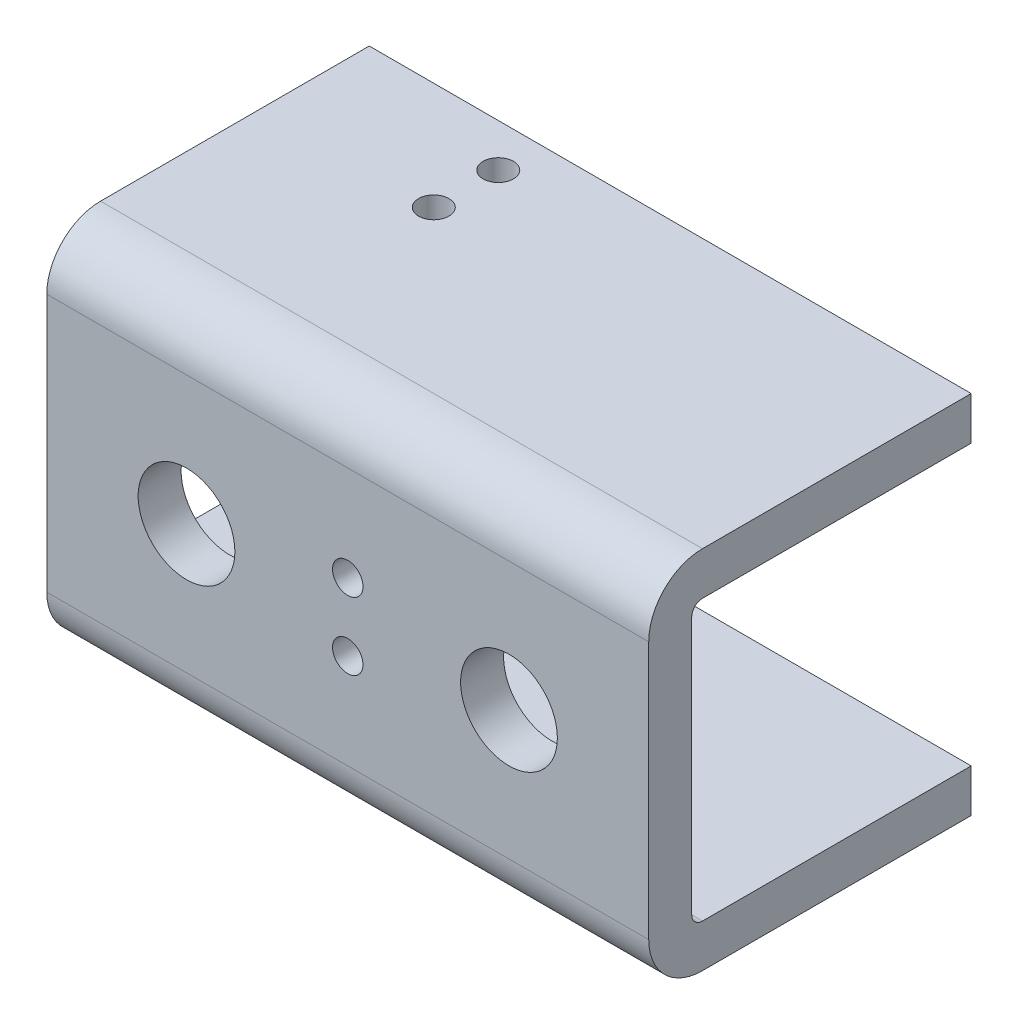
ISO-10303-21;
HEADER;
FILE_DESCRIPTION(('STEP AP214'),'2;1');
FILE_NAME('part.step','',(''),(''),'','','');
FILE_SCHEMA(('AUTOMOTIVE_DESIGN { 1 0 10303 214 1 1 1 1 }'));
ENDSEC;
DATA;
#1=APPLICATION_CONTEXT('core data for automotive mechanical design processes');
#2=APPLICATION_PROTOCOL_DEFINITION('international standard','automotive_design',2000,#1);
#3=PRODUCT_CONTEXT('',#1,'mechanical');
#4=PRODUCT('Part','Part','',(#3));
#5=PRODUCT_RELATED_PRODUCT_CATEGORY('part','',(#4));
#6=PRODUCT_DEFINITION_FORMATION('','',#4);
#7=PRODUCT_DEFINITION_CONTEXT('part definition',#1,'design');
#8=PRODUCT_DEFINITION('design','',#6,#7);
#9=PRODUCT_DEFINITION_SHAPE('','',#8);
#10=(LENGTH_UNIT() NAMED_UNIT(*) SI_UNIT(.MILLI.,.METRE.));
#11=(NAMED_UNIT(*) PLANE_ANGLE_UNIT() SI_UNIT($,.RADIAN.));
#12=(NAMED_UNIT(*) SI_UNIT($,.STERADIAN.) SOLID_ANGLE_UNIT());
#13=UNCERTAINTY_MEASURE_WITH_UNIT(LENGTH_MEASURE(1.E-05),#10,'distance_accuracy_value','');
#14=(GEOMETRIC_REPRESENTATION_CONTEXT(3) GLOBAL_UNCERTAINTY_ASSIGNED_CONTEXT((#13)) GLOBAL_UNIT_ASSIGNED_CONTEXT((#10,
#11,#12)) REPRESENTATION_CONTEXT('',''));
#15=CARTESIAN_POINT('',(0.,0.,0.));
#16=DIRECTION('',(0.,0.,1.));
#17=DIRECTION('',(1.,0.,0.));
#18=AXIS2_PLACEMENT_3D('',#15,#16,#17);
#19=CARTESIAN_POINT('',(44.45,26.9875,20.6375));
#20=DIRECTION('',(-1.,0.,0.));
#21=DIRECTION('',(0.,0.,1.));
#22=AXIS2_PLACEMENT_3D('',#19,#20,#21);
#23=PLANE('',#22);
#24=DIRECTION('',(0.,0.,-1.));
#25=VECTOR('',#24,1.);
#26=CARTESIAN_POINT('',(44.45,-20.6375,20.6375));
#27=LINE('',#26,#25);
#28=CARTESIAN_POINT('',(44.45,-20.6375,12.7));
#29=VERTEX_POINT('',#28);
#30=CARTESIAN_POINT('',(44.45,-20.6375,-26.9875));
#31=VERTEX_POINT('',#30);
#32=EDGE_CURVE('E132',#29,#31,#27,.T.);
#33=ORIENTED_EDGE('',*,*,#32,.F.);
#34=CARTESIAN_POINT('',(44.45,-19.05,12.7));
#35=DIRECTION('',(-1.,0.,0.));
#36=DIRECTION('',(0.,0.,1.));
#37=AXIS2_PLACEMENT_3D('',#34,#35,#36);
#38=CIRCLE('',#37,1.5875);
#39=CARTESIAN_POINT('',(44.45,-19.05,14.2875));
#40=VERTEX_POINT('',#39);
#41=EDGE_CURVE('E251',#40,#29,#38,.F.);
#42=ORIENTED_EDGE('',*,*,#41,.F.);
#43=DIRECTION('',(0.,1.,0.));
#44=VECTOR('',#43,1.);
#45=CARTESIAN_POINT('',(44.45,26.9875,14.2875));
#46=LINE('',#45,#44);
#47=CARTESIAN_POINT('',(44.45,19.05,14.2875));
#48=VERTEX_POINT('',#47);
#49=EDGE_CURVE('E272',#40,#48,#46,.T.);
#50=ORIENTED_EDGE('',*,*,#49,.T.);
#51=CARTESIAN_POINT('',(44.45,19.05,12.7));
#52=DIRECTION('',(-1.,0.,0.));
#53=DIRECTION('',(0.,0.,1.));
#54=AXIS2_PLACEMENT_3D('',#51,#52,#53);
#55=CIRCLE('',#54,1.5875);
#56=CARTESIAN_POINT('',(44.45,20.6375,12.7));
#57=VERTEX_POINT('',#56);
#58=EDGE_CURVE('E255',#57,#48,#55,.F.);
#59=ORIENTED_EDGE('',*,*,#58,.F.);
#60=DIRECTION('',(0.,0.,-1.));
#61=VECTOR('',#60,1.);
#62=CARTESIAN_POINT('',(44.45,20.6375,20.6375));
#63=LINE('',#62,#61);
#64=CARTESIAN_POINT('',(44.45,20.6375,-26.9875));
#65=VERTEX_POINT('',#64);
#66=EDGE_CURVE('E144',#57,#65,#63,.T.);
#67=ORIENTED_EDGE('',*,*,#66,.T.);
#68=DIRECTION('',(0.,-1.,0.));
#69=VECTOR('',#68,1.);
#70=CARTESIAN_POINT('',(44.45,26.9875,-26.9875));
#71=LINE('',#70,#69);
#72=CARTESIAN_POINT('',(44.45,26.9875,-26.9875));
#73=VERTEX_POINT('',#72);
#74=EDGE_CURVE('E162',#73,#65,#71,.T.);
#75=ORIENTED_EDGE('',*,*,#74,.F.);
#76=DIRECTION('',(0.,0.,-1.));
#77=VECTOR('',#76,1.);
#78=CARTESIAN_POINT('',(44.45,26.9875,20.6375));
#79=LINE('',#78,#77);
#80=CARTESIAN_POINT('',(44.45,26.9875,12.7));
#81=VERTEX_POINT('',#80);
#82=EDGE_CURVE('E183',#81,#73,#79,.T.);
#83=ORIENTED_EDGE('',*,*,#82,.F.);
#84=CARTESIAN_POINT('',(44.45,19.05,12.7));
#85=DIRECTION('',(-1.,0.,0.));
#86=DIRECTION('',(0.,0.,1.));
#87=AXIS2_PLACEMENT_3D('',#84,#85,#86);
#88=CIRCLE('',#87,7.9375);
#89=CARTESIAN_POINT('',(44.45,19.05,20.6375));
#90=VERTEX_POINT('',#89);
#91=EDGE_CURVE('E199',#81,#90,#88,.F.);
#92=ORIENTED_EDGE('',*,*,#91,.T.);
#93=DIRECTION('',(0.,1.,0.));
#94=VECTOR('',#93,1.);
#95=CARTESIAN_POINT('',(44.45,26.9875,20.6375));
#96=LINE('',#95,#94);
#97=CARTESIAN_POINT('',(44.45,-19.05,20.6375));
#98=VERTEX_POINT('',#97);
#99=EDGE_CURVE('E176',#98,#90,#96,.T.);
#100=ORIENTED_EDGE('',*,*,#99,.F.);
#101=CARTESIAN_POINT('',(44.45,-19.05,12.7));
#102=DIRECTION('',(-1.,0.,0.));
#103=DIRECTION('',(0.,0.,1.));
#104=AXIS2_PLACEMENT_3D('',#101,#102,#103);
#105=CIRCLE('',#104,7.9375);
#106=CARTESIAN_POINT('',(44.45,-26.9875,12.7));
#107=VERTEX_POINT('',#106);
#108=EDGE_CURVE('E202',#98,#107,#105,.F.);
#109=ORIENTED_EDGE('',*,*,#108,.T.);
#110=DIRECTION('',(0.,0.,-1.));
#111=VECTOR('',#110,1.);
#112=CARTESIAN_POINT('',(44.45,-26.9875,20.6375));
#113=LINE('',#112,#111);
#114=CARTESIAN_POINT('',(44.45,-26.9875,-26.9875));
#115=VERTEX_POINT('',#114);
#116=EDGE_CURVE('E159',#107,#115,#113,.T.);
#117=ORIENTED_EDGE('',*,*,#116,.T.);
#118=EDGE_CURVE('E150',#31,#115,#71,.T.);
#119=ORIENTED_EDGE('',*,*,#118,.F.);
#120=EDGE_LOOP('',(#33,#42,#50,#59,#67,#75,#83,#92,#100,#109,#117,#119));
#121=FACE_BOUND('',#120,.T.);
#122=ADVANCED_FACE('F39',(#121),#23,.F.);
#123=CARTESIAN_POINT('',(0.,0.,-26.9875));
#124=DIRECTION('',(0.,0.,-1.));
#125=DIRECTION('',(-1.,0.,0.));
#126=AXIS2_PLACEMENT_3D('',#123,#124,#125);
#127=PLANE('',#126);
#128=DIRECTION('',(-1.,0.,0.));
#129=VECTOR('',#128,1.);
#130=CARTESIAN_POINT('',(-44.45,-20.6375,-26.9875));
#131=LINE('',#130,#129);
#132=CARTESIAN_POINT('',(-44.45,-20.6375,-26.9875));
#133=VERTEX_POINT('',#132);
#134=EDGE_CURVE('E136',#31,#133,#131,.T.);
#135=ORIENTED_EDGE('',*,*,#134,.F.);
#136=ORIENTED_EDGE('',*,*,#118,.T.);
#137=DIRECTION('',(-1.,0.,0.));
#138=VECTOR('',#137,1.);
#139=CARTESIAN_POINT('',(44.45,-26.9875,-26.9875));
#140=LINE('',#139,#138);
#141=CARTESIAN_POINT('',(-44.45,-26.9875,-26.9875));
#142=VERTEX_POINT('',#141);
#143=EDGE_CURVE('E261',#115,#142,#140,.T.);
#144=ORIENTED_EDGE('',*,*,#143,.T.);
#145=DIRECTION('',(0.,1.,0.));
#146=VECTOR('',#145,1.);
#147=CARTESIAN_POINT('',(-44.45,-26.9875,-26.9875));
#148=LINE('',#147,#146);
#149=EDGE_CURVE('E153',#142,#133,#148,.T.);
#150=ORIENTED_EDGE('',*,*,#149,.T.);
#151=EDGE_LOOP('',(#135,#136,#144,#150));
#152=FACE_BOUND('',#151,.T.);
#153=ADVANCED_FACE('F148',(#152),#127,.T.);
#154=CARTESIAN_POINT('',(-44.45,26.9875,20.6375));
#155=DIRECTION('',(1.,0.,0.));
#156=DIRECTION('',(0.,0.,-1.));
#157=AXIS2_PLACEMENT_3D('',#154,#155,#156);
#158=PLANE('',#157);
#159=CARTESIAN_POINT('',(-44.45,-19.05,12.7));
#160=DIRECTION('',(1.,0.,0.));
#161=DIRECTION('',(0.,0.,-1.));
#162=AXIS2_PLACEMENT_3D('',#159,#160,#161);
#163=CIRCLE('',#162,1.5875);
#164=CARTESIAN_POINT('',(-44.45,-20.6375,12.7));
#165=VERTEX_POINT('',#164);
#166=CARTESIAN_POINT('',(-44.45,-19.05,14.2875));
#167=VERTEX_POINT('',#166);
#168=EDGE_CURVE('E262',#165,#167,#163,.F.);
#169=ORIENTED_EDGE('',*,*,#168,.F.);
#170=DIRECTION('',(0.,0.,-1.));
#171=VECTOR('',#170,1.);
#172=CARTESIAN_POINT('',(-44.45,-20.6375,20.6375));
#173=LINE('',#172,#171);
#174=EDGE_CURVE('E143',#165,#133,#173,.T.);
#175=ORIENTED_EDGE('',*,*,#174,.T.);
#176=ORIENTED_EDGE('',*,*,#149,.F.);
#177=DIRECTION('',(0.,0.,-1.));
#178=VECTOR('',#177,1.);
#179=CARTESIAN_POINT('',(-44.45,-26.9875,20.6375));
#180=LINE('',#179,#178);
#181=CARTESIAN_POINT('',(-44.45,-26.9875,12.7));
#182=VERTEX_POINT('',#181);
#183=EDGE_CURVE('E188',#182,#142,#180,.T.);
#184=ORIENTED_EDGE('',*,*,#183,.F.);
#185=CARTESIAN_POINT('',(-44.45,-19.05,12.7));
#186=DIRECTION('',(1.,0.,0.));
#187=DIRECTION('',(0.,0.,-1.));
#188=AXIS2_PLACEMENT_3D('',#185,#186,#187);
#189=CIRCLE('',#188,7.9375);
#190=CARTESIAN_POINT('',(-44.45,-19.05,20.6375));
#191=VERTEX_POINT('',#190);
#192=EDGE_CURVE('E49',#182,#191,#189,.F.);
#193=ORIENTED_EDGE('',*,*,#192,.T.);
#194=DIRECTION('',(0.,-1.,0.));
#195=VECTOR('',#194,1.);
#196=CARTESIAN_POINT('',(-44.45,26.9875,20.6375));
#197=LINE('',#196,#195);
#198=CARTESIAN_POINT('',(-44.45,19.05,20.6375));
#199=VERTEX_POINT('',#198);
#200=EDGE_CURVE('E168',#199,#191,#197,.T.);
#201=ORIENTED_EDGE('',*,*,#200,.F.);
#202=CARTESIAN_POINT('',(-44.45,19.05,12.7));
#203=DIRECTION('',(1.,0.,0.));
#204=DIRECTION('',(0.,0.,-1.));
#205=AXIS2_PLACEMENT_3D('',#202,#203,#204);
#206=CIRCLE('',#205,7.9375);
#207=CARTESIAN_POINT('',(-44.45,26.9875,12.7));
#208=VERTEX_POINT('',#207);
#209=EDGE_CURVE('E65',#199,#208,#206,.F.);
#210=ORIENTED_EDGE('',*,*,#209,.T.);
#211=DIRECTION('',(0.,0.,-1.));
#212=VECTOR('',#211,1.);
#213=CARTESIAN_POINT('',(-44.45,26.9875,20.6375));
#214=LINE('',#213,#212);
#215=CARTESIAN_POINT('',(-44.45,26.9875,-26.9875));
#216=VERTEX_POINT('',#215);
#217=EDGE_CURVE('E180',#208,#216,#214,.T.);
#218=ORIENTED_EDGE('',*,*,#217,.T.);
#219=CARTESIAN_POINT('',(-44.45,20.6375,-26.9875));
#220=VERTEX_POINT('',#219);
#221=EDGE_CURVE('E290',#220,#216,#148,.T.);
#222=ORIENTED_EDGE('',*,*,#221,.F.);
#223=DIRECTION('',(0.,0.,-1.));
#224=VECTOR('',#223,1.);
#225=CARTESIAN_POINT('',(-44.45,20.6375,20.6375));
#226=LINE('',#225,#224);
#227=CARTESIAN_POINT('',(-44.45,20.6375,12.7));
#228=VERTEX_POINT('',#227);
#229=EDGE_CURVE('E57',#228,#220,#226,.T.);
#230=ORIENTED_EDGE('',*,*,#229,.F.);
#231=CARTESIAN_POINT('',(-44.45,19.05,12.7));
#232=DIRECTION('',(1.,0.,0.));
#233=DIRECTION('',(0.,0.,-1.));
#234=AXIS2_PLACEMENT_3D('',#231,#232,#233);
#235=CIRCLE('',#234,1.5875);
#236=CARTESIAN_POINT('',(-44.45,19.05,14.2875));
#237=VERTEX_POINT('',#236);
#238=EDGE_CURVE('E250',#237,#228,#235,.F.);
#239=ORIENTED_EDGE('',*,*,#238,.F.);
#240=DIRECTION('',(0.,-1.,0.));
#241=VECTOR('',#240,1.);
#242=CARTESIAN_POINT('',(-44.45,26.9875,14.2875));
#243=LINE('',#242,#241);
#244=EDGE_CURVE('E268',#237,#167,#243,.T.);
#245=ORIENTED_EDGE('',*,*,#244,.T.);
#246=EDGE_LOOP('',(#169,#175,#176,#184,#193,#201,#210,#218,#222,#230,#239,#245));
#247=FACE_BOUND('',#246,.T.);
#248=ADVANCED_FACE('F299',(#247),#158,.F.);
#249=CARTESIAN_POINT('',(-44.45,-26.9875,20.6375));
#250=DIRECTION('',(0.,1.,0.));
#251=DIRECTION('',(0.,0.,1.));
#252=AXIS2_PLACEMENT_3D('',#249,#250,#251);
#253=PLANE('',#252);
#254=CARTESIAN_POINT('',(-19.05,-26.9875,-11.1125));
#255=DIRECTION('',(0.,1.,0.));
#256=DIRECTION('',(0.,0.,1.));
#257=AXIS2_PLACEMENT_3D('',#254,#255,#256);
#258=CIRCLE('',#257,2.24789999999999);
#259=CARTESIAN_POINT('',(-19.05,-26.9875,-8.86460000000001));
#260=VERTEX_POINT('',#259);
#261=EDGE_CURVE('E567',#260,#260,#258,.T.);
#262=ORIENTED_EDGE('',*,*,#261,.T.);
#263=EDGE_LOOP('',(#262));
#264=FACE_BOUND('',#263,.T.);
#265=CARTESIAN_POINT('',(-19.05,-26.9875,-20.6375));
#266=DIRECTION('',(0.,1.,0.));
#267=DIRECTION('',(0.,0.,1.));
#268=AXIS2_PLACEMENT_3D('',#265,#266,#267);
#269=CIRCLE('',#268,2.24789999999999);
#270=CARTESIAN_POINT('',(-19.05,-26.9875,-18.3896));
#271=VERTEX_POINT('',#270);
#272=EDGE_CURVE('E224',#271,#271,#269,.T.);
#273=ORIENTED_EDGE('',*,*,#272,.T.);
#274=EDGE_LOOP('',(#273));
#275=FACE_BOUND('',#274,.T.);
#276=ORIENTED_EDGE('',*,*,#116,.F.);
#277=DIRECTION('',(1.,0.,0.));
#278=VECTOR('',#277,1.);
#279=CARTESIAN_POINT('',(-44.45,-26.9875,12.7));
#280=LINE('',#279,#278);
#281=EDGE_CURVE('E205',#107,#182,#280,.F.);
#282=ORIENTED_EDGE('',*,*,#281,.T.);
#283=ORIENTED_EDGE('',*,*,#183,.T.);
#284=ORIENTED_EDGE('',*,*,#143,.F.);
#285=EDGE_LOOP('',(#276,#282,#283,#284));
#286=FACE_BOUND('',#285,.T.);
#287=ADVANCED_FACE('F317',(#264,#275,#286),#253,.F.);
#288=CARTESIAN_POINT('',(-44.45,26.9875,20.6375));
#289=DIRECTION('',(0.,-1.,0.));
#290=DIRECTION('',(0.,0.,-1.));
#291=AXIS2_PLACEMENT_3D('',#288,#289,#290);
#292=PLANE('',#291);
#293=CARTESIAN_POINT('',(-19.05,26.9875,-11.1125));
#294=DIRECTION('',(0.,1.,0.));
#295=DIRECTION('',(0.,0.,1.));
#296=AXIS2_PLACEMENT_3D('',#293,#294,#295);
#297=CIRCLE('',#296,2.24789999999999);
#298=CARTESIAN_POINT('',(-19.05,26.9875,-8.8646));
#299=VERTEX_POINT('',#298);
#300=EDGE_CURVE('E563',#299,#299,#297,.T.);
#301=ORIENTED_EDGE('',*,*,#300,.F.);
#302=EDGE_LOOP('',(#301));
#303=FACE_BOUND('',#302,.T.);
#304=CARTESIAN_POINT('',(-19.05,26.9875,-20.6375));
#305=DIRECTION('',(0.,1.,0.));
#306=DIRECTION('',(0.,0.,1.));
#307=AXIS2_PLACEMENT_3D('',#304,#305,#306);
#308=CIRCLE('',#307,2.24789999999999);
#309=CARTESIAN_POINT('',(-19.05,26.9875,-18.3896));
#310=VERTEX_POINT('',#309);
#311=EDGE_CURVE('E232',#310,#310,#308,.T.);
#312=ORIENTED_EDGE('',*,*,#311,.F.);
#313=EDGE_LOOP('',(#312));
#314=FACE_BOUND('',#313,.T.);
#315=ORIENTED_EDGE('',*,*,#217,.F.);
#316=DIRECTION('',(-1.,0.,0.));
#317=VECTOR('',#316,1.);
#318=CARTESIAN_POINT('',(44.45,26.9875,12.7));
#319=LINE('',#318,#317);
#320=EDGE_CURVE('E11',#208,#81,#319,.F.);
#321=ORIENTED_EDGE('',*,*,#320,.T.);
#322=ORIENTED_EDGE('',*,*,#82,.T.);
#323=DIRECTION('',(1.,0.,0.));
#324=VECTOR('',#323,1.);
#325=CARTESIAN_POINT('',(-44.45,26.9875,-26.9875));
#326=LINE('',#325,#324);
#327=EDGE_CURVE('E163',#216,#73,#326,.T.);
#328=ORIENTED_EDGE('',*,*,#327,.F.);
#329=EDGE_LOOP('',(#315,#321,#322,#328));
#330=FACE_BOUND('',#329,.T.);
#331=ADVANCED_FACE('F302',(#303,#314,#330),#292,.F.);
#332=CARTESIAN_POINT('',(-44.45,-26.9875,20.6375));
#333=DIRECTION('',(0.,0.,1.));
#334=DIRECTION('',(1.,0.,0.));
#335=AXIS2_PLACEMENT_3D('',#332,#333,#334);
#336=PLANE('',#335);
#337=CARTESIAN_POINT('',(0.,-5.,20.6375));
#338=DIRECTION('',(0.,0.,1.));
#339=DIRECTION('',(1.,0.,0.));
#340=AXIS2_PLACEMENT_3D('',#337,#338,#339);
#341=CIRCLE('',#340,2.24789999999999);
#342=CARTESIAN_POINT('',(2.2479,-5.,20.6375));
#343=VERTEX_POINT('',#342);
#344=EDGE_CURVE('E548',#343,#343,#341,.T.);
#345=ORIENTED_EDGE('',*,*,#344,.F.);
#346=EDGE_LOOP('',(#345));
#347=FACE_BOUND('',#346,.T.);
#348=CARTESIAN_POINT('',(0.,5.,20.6375));
#349=DIRECTION('',(0.,0.,1.));
#350=DIRECTION('',(1.,0.,0.));
#351=AXIS2_PLACEMENT_3D('',#348,#349,#350);
#352=CIRCLE('',#351,2.24789999999999);
#353=CARTESIAN_POINT('',(2.24789999999999,5.,20.6375));
#354=VERTEX_POINT('',#353);
#355=EDGE_CURVE('E552',#354,#354,#352,.T.);
#356=ORIENTED_EDGE('',*,*,#355,.F.);
#357=EDGE_LOOP('',(#356));
#358=FACE_BOUND('',#357,.T.);
#359=CARTESIAN_POINT('',(23.8125,0.,20.6375));
#360=DIRECTION('',(0.,0.,1.));
#361=DIRECTION('',(1.,0.,0.));
#362=AXIS2_PLACEMENT_3D('',#359,#360,#361);
#363=CIRCLE('',#362,7.14375);
#364=CARTESIAN_POINT('',(30.95625,0.,20.6375));
#365=VERTEX_POINT('',#364);
#366=EDGE_CURVE('E219',#365,#365,#363,.T.);
#367=ORIENTED_EDGE('',*,*,#366,.F.);
#368=EDGE_LOOP('',(#367));
#369=FACE_BOUND('',#368,.T.);
#370=CARTESIAN_POINT('',(-23.8125,0.,20.6375));
#371=DIRECTION('',(0.,0.,1.));
#372=DIRECTION('',(1.,0.,0.));
#373=AXIS2_PLACEMENT_3D('',#370,#371,#372);
#374=CIRCLE('',#373,7.14375);
#375=CARTESIAN_POINT('',(-16.66875,0.,20.6375));
#376=VERTEX_POINT('',#375);
#377=EDGE_CURVE('E215',#376,#376,#374,.T.);
#378=ORIENTED_EDGE('',*,*,#377,.F.);
#379=EDGE_LOOP('',(#378));
#380=FACE_BOUND('',#379,.T.);
#381=ORIENTED_EDGE('',*,*,#200,.T.);
#382=DIRECTION('',(1.,0.,0.));
#383=VECTOR('',#382,1.);
#384=CARTESIAN_POINT('',(44.45,-19.05,20.6375));
#385=LINE('',#384,#383);
#386=EDGE_CURVE('E195',#191,#98,#385,.T.);
#387=ORIENTED_EDGE('',*,*,#386,.T.);
#388=ORIENTED_EDGE('',*,*,#99,.T.);
#389=DIRECTION('',(-1.,0.,0.));
#390=VECTOR('',#389,1.);
#391=CARTESIAN_POINT('',(-44.45,19.05,20.6375));
#392=LINE('',#391,#390);
#393=EDGE_CURVE('E191',#90,#199,#392,.T.);
#394=ORIENTED_EDGE('',*,*,#393,.T.);
#395=EDGE_LOOP('',(#381,#387,#388,#394));
#396=FACE_BOUND('',#395,.T.);
#397=ADVANCED_FACE('F309',(#347,#358,#369,#380,#396),#336,.T.);
#398=CARTESIAN_POINT('',(-44.45,-19.05,12.7));
#399=DIRECTION('',(-1.,0.,0.));
#400=DIRECTION('',(0.,0.,1.));
#401=AXIS2_PLACEMENT_3D('',#398,#399,#400);
#402=CYLINDRICAL_SURFACE('',#401,7.9375);
#403=ORIENTED_EDGE('',*,*,#192,.F.);
#404=ORIENTED_EDGE('',*,*,#281,.F.);
#405=ORIENTED_EDGE('',*,*,#108,.F.);
#406=ORIENTED_EDGE('',*,*,#386,.F.);
#407=EDGE_LOOP('',(#403,#404,#405,#406));
#408=FACE_BOUND('',#407,.T.);
#409=ADVANCED_FACE('F315',(#408),#402,.T.);
#410=CARTESIAN_POINT('',(-44.45,19.05,12.7));
#411=DIRECTION('',(1.,0.,0.));
#412=DIRECTION('',(0.,0.,-1.));
#413=AXIS2_PLACEMENT_3D('',#410,#411,#412);
#414=CYLINDRICAL_SURFACE('',#413,7.9375);
#415=ORIENTED_EDGE('',*,*,#91,.F.);
#416=ORIENTED_EDGE('',*,*,#320,.F.);
#417=ORIENTED_EDGE('',*,*,#209,.F.);
#418=ORIENTED_EDGE('',*,*,#393,.F.);
#419=EDGE_LOOP('',(#415,#416,#417,#418));
#420=FACE_BOUND('',#419,.T.);
#421=ADVANCED_FACE('F41',(#420),#414,.T.);
#422=DIRECTION('',(1.,0.,0.));
#423=VECTOR('',#422,1.);
#424=CARTESIAN_POINT('',(-44.45,20.6375,-26.9875));
#425=LINE('',#424,#423);
#426=EDGE_CURVE('E155',#220,#65,#425,.T.);
#427=ORIENTED_EDGE('',*,*,#426,.F.);
#428=ORIENTED_EDGE('',*,*,#221,.T.);
#429=ORIENTED_EDGE('',*,*,#327,.T.);
#430=ORIENTED_EDGE('',*,*,#74,.T.);
#431=EDGE_LOOP('',(#427,#428,#429,#430));
#432=FACE_BOUND('',#431,.T.);
#433=ADVANCED_FACE('F295',(#432),#127,.T.);
#434=CARTESIAN_POINT('',(-44.45,-20.6375,20.6375));
#435=DIRECTION('',(0.,1.,0.));
#436=DIRECTION('',(0.,0.,1.));
#437=AXIS2_PLACEMENT_3D('',#434,#435,#436);
#438=PLANE('',#437);
#439=CARTESIAN_POINT('',(-19.05,-20.6375,-11.1125));
#440=DIRECTION('',(0.,1.,0.));
#441=DIRECTION('',(0.,0.,1.));
#442=AXIS2_PLACEMENT_3D('',#439,#440,#441);
#443=CIRCLE('',#442,2.24789999999999);
#444=CARTESIAN_POINT('',(-19.05,-20.6375,-8.8646));
#445=VERTEX_POINT('',#444);
#446=EDGE_CURVE('E571',#445,#445,#443,.T.);
#447=ORIENTED_EDGE('',*,*,#446,.F.);
#448=EDGE_LOOP('',(#447));
#449=FACE_BOUND('',#448,.T.);
#450=CARTESIAN_POINT('',(-19.05,-20.6375,-20.6375));
#451=DIRECTION('',(0.,1.,0.));
#452=DIRECTION('',(0.,0.,1.));
#453=AXIS2_PLACEMENT_3D('',#450,#451,#452);
#454=CIRCLE('',#453,2.24789999999999);
#455=CARTESIAN_POINT('',(-19.05,-20.6375,-18.3896));
#456=VERTEX_POINT('',#455);
#457=EDGE_CURVE('E223',#456,#456,#454,.T.);
#458=ORIENTED_EDGE('',*,*,#457,.F.);
#459=EDGE_LOOP('',(#458));
#460=FACE_BOUND('',#459,.T.);
#461=ORIENTED_EDGE('',*,*,#32,.T.);
#462=ORIENTED_EDGE('',*,*,#134,.T.);
#463=ORIENTED_EDGE('',*,*,#174,.F.);
#464=DIRECTION('',(1.,0.,0.));
#465=VECTOR('',#464,1.);
#466=CARTESIAN_POINT('',(-44.45,-20.6375,12.7));
#467=LINE('',#466,#465);
#468=EDGE_CURVE('E138',#29,#165,#467,.F.);
#469=ORIENTED_EDGE('',*,*,#468,.F.);
#470=EDGE_LOOP('',(#461,#462,#463,#469));
#471=FACE_BOUND('',#470,.T.);
#472=ADVANCED_FACE('F134',(#449,#460,#471),#438,.T.);
#473=CARTESIAN_POINT('',(-44.45,20.6375,20.6375));
#474=DIRECTION('',(0.,-1.,0.));
#475=DIRECTION('',(0.,0.,-1.));
#476=AXIS2_PLACEMENT_3D('',#473,#474,#475);
#477=PLANE('',#476);
#478=CARTESIAN_POINT('',(-19.05,20.6375,-11.1125));
#479=DIRECTION('',(0.,-1.,0.));
#480=DIRECTION('',(0.,0.,-1.));
#481=AXIS2_PLACEMENT_3D('',#478,#479,#480);
#482=CIRCLE('',#481,2.24789999999999);
#483=CARTESIAN_POINT('',(-19.05,20.6375,-13.3604));
#484=VERTEX_POINT('',#483);
#485=EDGE_CURVE('E238',#484,#484,#482,.T.);
#486=ORIENTED_EDGE('',*,*,#485,.F.);
#487=EDGE_LOOP('',(#486));
#488=FACE_BOUND('',#487,.T.);
#489=CARTESIAN_POINT('',(-19.05,20.6375,-20.6375));
#490=DIRECTION('',(0.,-1.,0.));
#491=DIRECTION('',(0.,0.,-1.));
#492=AXIS2_PLACEMENT_3D('',#489,#490,#491);
#493=CIRCLE('',#492,2.24789999999999);
#494=CARTESIAN_POINT('',(-19.05,20.6375,-22.8854));
#495=VERTEX_POINT('',#494);
#496=EDGE_CURVE('E220',#495,#495,#493,.T.);
#497=ORIENTED_EDGE('',*,*,#496,.F.);
#498=EDGE_LOOP('',(#497));
#499=FACE_BOUND('',#498,.T.);
#500=ORIENTED_EDGE('',*,*,#229,.T.);
#501=ORIENTED_EDGE('',*,*,#426,.T.);
#502=ORIENTED_EDGE('',*,*,#66,.F.);
#503=DIRECTION('',(1.,0.,0.));
#504=VECTOR('',#503,1.);
#505=CARTESIAN_POINT('',(-44.45,20.6375,12.7));
#506=LINE('',#505,#504);
#507=EDGE_CURVE('E259',#228,#57,#506,.T.);
#508=ORIENTED_EDGE('',*,*,#507,.F.);
#509=EDGE_LOOP('',(#500,#501,#502,#508));
#510=FACE_BOUND('',#509,.T.);
#511=ADVANCED_FACE('F331',(#488,#499,#510),#477,.T.);
#512=CARTESIAN_POINT('',(-44.45,-26.9875,14.2875));
#513=DIRECTION('',(0.,0.,1.));
#514=DIRECTION('',(1.,0.,0.));
#515=AXIS2_PLACEMENT_3D('',#512,#513,#514);
#516=PLANE('',#515);
#517=CARTESIAN_POINT('',(0.,-5.,14.2875));
#518=DIRECTION('',(0.,0.,1.));
#519=DIRECTION('',(1.,0.,0.));
#520=AXIS2_PLACEMENT_3D('',#517,#518,#519);
#521=CIRCLE('',#520,2.24789999999999);
#522=CARTESIAN_POINT('',(2.24789999999999,-5.,14.2875));
#523=VERTEX_POINT('',#522);
#524=EDGE_CURVE('E43',#523,#523,#521,.T.);
#525=ORIENTED_EDGE('',*,*,#524,.T.);
#526=EDGE_LOOP('',(#525));
#527=FACE_BOUND('',#526,.T.);
#528=CARTESIAN_POINT('',(0.,5.,14.2875));
#529=DIRECTION('',(0.,0.,1.));
#530=DIRECTION('',(1.,0.,0.));
#531=AXIS2_PLACEMENT_3D('',#528,#529,#530);
#532=CIRCLE('',#531,2.24789999999999);
#533=CARTESIAN_POINT('',(2.24789999999999,5.,14.2875));
#534=VERTEX_POINT('',#533);
#535=EDGE_CURVE('E556',#534,#534,#532,.T.);
#536=ORIENTED_EDGE('',*,*,#535,.T.);
#537=EDGE_LOOP('',(#536));
#538=FACE_BOUND('',#537,.T.);
#539=CARTESIAN_POINT('',(23.8125,0.,14.2875));
#540=DIRECTION('',(0.,0.,1.));
#541=DIRECTION('',(1.,0.,0.));
#542=AXIS2_PLACEMENT_3D('',#539,#540,#541);
#543=CIRCLE('',#542,7.14375);
#544=CARTESIAN_POINT('',(30.95625,0.,14.2875));
#545=VERTEX_POINT('',#544);
#546=EDGE_CURVE('E216',#545,#545,#543,.T.);
#547=ORIENTED_EDGE('',*,*,#546,.T.);
#548=EDGE_LOOP('',(#547));
#549=FACE_BOUND('',#548,.T.);
#550=CARTESIAN_POINT('',(-23.8125,0.,14.2875));
#551=DIRECTION('',(0.,0.,1.));
#552=DIRECTION('',(1.,0.,0.));
#553=AXIS2_PLACEMENT_3D('',#550,#551,#552);
#554=CIRCLE('',#553,7.14375);
#555=CARTESIAN_POINT('',(-16.66875,0.,14.2875));
#556=VERTEX_POINT('',#555);
#557=EDGE_CURVE('E156',#556,#556,#554,.T.);
#558=ORIENTED_EDGE('',*,*,#557,.T.);
#559=EDGE_LOOP('',(#558));
#560=FACE_BOUND('',#559,.T.);
#561=ORIENTED_EDGE('',*,*,#244,.F.);
#562=DIRECTION('',(1.,0.,0.));
#563=VECTOR('',#562,1.);
#564=CARTESIAN_POINT('',(-44.45,19.05,14.2875));
#565=LINE('',#564,#563);
#566=EDGE_CURVE('E256',#48,#237,#565,.F.);
#567=ORIENTED_EDGE('',*,*,#566,.F.);
#568=ORIENTED_EDGE('',*,*,#49,.F.);
#569=DIRECTION('',(1.,0.,0.));
#570=VECTOR('',#569,1.);
#571=CARTESIAN_POINT('',(-44.45,-19.05,14.2875));
#572=LINE('',#571,#570);
#573=EDGE_CURVE('E252',#167,#40,#572,.T.);
#574=ORIENTED_EDGE('',*,*,#573,.F.);
#575=EDGE_LOOP('',(#561,#567,#568,#574));
#576=FACE_BOUND('',#575,.T.);
#577=ADVANCED_FACE('F325',(#527,#538,#549,#560,#576),#516,.F.);
#578=CARTESIAN_POINT('',(-44.45,-19.05,12.7));
#579=DIRECTION('',(-1.,0.,0.));
#580=DIRECTION('',(0.,0.,1.));
#581=AXIS2_PLACEMENT_3D('',#578,#579,#580);
#582=CYLINDRICAL_SURFACE('',#581,1.5875);
#583=ORIENTED_EDGE('',*,*,#168,.T.);
#584=ORIENTED_EDGE('',*,*,#573,.T.);
#585=ORIENTED_EDGE('',*,*,#41,.T.);
#586=ORIENTED_EDGE('',*,*,#468,.T.);
#587=EDGE_LOOP('',(#583,#584,#585,#586));
#588=FACE_BOUND('',#587,.T.);
#589=ADVANCED_FACE('F322',(#588),#582,.F.);
#590=CARTESIAN_POINT('',(-44.45,19.05,12.7));
#591=DIRECTION('',(1.,0.,0.));
#592=DIRECTION('',(0.,0.,-1.));
#593=AXIS2_PLACEMENT_3D('',#590,#591,#592);
#594=CYLINDRICAL_SURFACE('',#593,1.5875);
#595=ORIENTED_EDGE('',*,*,#58,.T.);
#596=ORIENTED_EDGE('',*,*,#566,.T.);
#597=ORIENTED_EDGE('',*,*,#238,.T.);
#598=ORIENTED_EDGE('',*,*,#507,.T.);
#599=EDGE_LOOP('',(#595,#596,#597,#598));
#600=FACE_BOUND('',#599,.T.);
#601=ADVANCED_FACE('F330',(#600),#594,.F.);
#602=CARTESIAN_POINT('',(-23.8125,0.,-26.9875));
#603=DIRECTION('',(0.,0.,1.));
#604=DIRECTION('',(1.,0.,0.));
#605=AXIS2_PLACEMENT_3D('',#602,#603,#604);
#606=CYLINDRICAL_SURFACE('',#605,7.14375);
#607=ORIENTED_EDGE('',*,*,#377,.T.);
#608=EDGE_LOOP('',(#607));
#609=FACE_BOUND('',#608,.T.);
#610=ORIENTED_EDGE('',*,*,#557,.F.);
#611=EDGE_LOOP('',(#610));
#612=FACE_BOUND('',#611,.T.);
#613=ADVANCED_FACE('F374',(#609,#612),#606,.F.);
#614=CARTESIAN_POINT('',(23.8125,0.,-26.9875));
#615=DIRECTION('',(0.,0.,1.));
#616=DIRECTION('',(1.,0.,0.));
#617=AXIS2_PLACEMENT_3D('',#614,#615,#616);
#618=CYLINDRICAL_SURFACE('',#617,7.14375);
#619=ORIENTED_EDGE('',*,*,#366,.T.);
#620=EDGE_LOOP('',(#619));
#621=FACE_BOUND('',#620,.T.);
#622=ORIENTED_EDGE('',*,*,#546,.F.);
#623=EDGE_LOOP('',(#622));
#624=FACE_BOUND('',#623,.T.);
#625=ADVANCED_FACE('F391',(#621,#624),#618,.F.);
#626=CARTESIAN_POINT('',(-19.05,26.9875,-20.6375));
#627=DIRECTION('',(0.,1.,0.));
#628=DIRECTION('',(0.,0.,1.));
#629=AXIS2_PLACEMENT_3D('',#626,#627,#628);
#630=CYLINDRICAL_SURFACE('',#629,2.24789999999999);
#631=ORIENTED_EDGE('',*,*,#496,.T.);
#632=EDGE_LOOP('',(#631));
#633=FACE_BOUND('',#632,.T.);
#634=ORIENTED_EDGE('',*,*,#311,.T.);
#635=EDGE_LOOP('',(#634));
#636=FACE_BOUND('',#635,.T.);
#637=ADVANCED_FACE('F399',(#633,#636),#630,.F.);
#638=ORIENTED_EDGE('',*,*,#457,.T.);
#639=EDGE_LOOP('',(#638));
#640=FACE_BOUND('',#639,.T.);
#641=ORIENTED_EDGE('',*,*,#272,.F.);
#642=EDGE_LOOP('',(#641));
#643=FACE_BOUND('',#642,.T.);
#644=ADVANCED_FACE('F408',(#640,#643),#630,.F.);
#645=CARTESIAN_POINT('',(-19.05,26.9875,-11.1125));
#646=DIRECTION('',(0.,1.,0.));
#647=DIRECTION('',(0.,0.,1.));
#648=AXIS2_PLACEMENT_3D('',#645,#646,#647);
#649=CYLINDRICAL_SURFACE('',#648,2.24789999999999);
#650=ORIENTED_EDGE('',*,*,#485,.T.);
#651=EDGE_LOOP('',(#650));
#652=FACE_BOUND('',#651,.T.);
#653=ORIENTED_EDGE('',*,*,#300,.T.);
#654=EDGE_LOOP('',(#653));
#655=FACE_BOUND('',#654,.T.);
#656=ADVANCED_FACE('F415',(#652,#655),#649,.F.);
#657=ORIENTED_EDGE('',*,*,#446,.T.);
#658=EDGE_LOOP('',(#657));
#659=FACE_BOUND('',#658,.T.);
#660=ORIENTED_EDGE('',*,*,#261,.F.);
#661=EDGE_LOOP('',(#660));
#662=FACE_BOUND('',#661,.T.);
#663=ADVANCED_FACE('F422',(#659,#662),#649,.F.);
#664=CARTESIAN_POINT('',(0.,5.,20.6375));
#665=DIRECTION('',(0.,0.,1.));
#666=DIRECTION('',(1.,0.,0.));
#667=AXIS2_PLACEMENT_3D('',#664,#665,#666);
#668=CYLINDRICAL_SURFACE('',#667,2.24789999999999);
#669=ORIENTED_EDGE('',*,*,#355,.T.);
#670=EDGE_LOOP('',(#669));
#671=FACE_BOUND('',#670,.T.);
#672=ORIENTED_EDGE('',*,*,#535,.F.);
#673=EDGE_LOOP('',(#672));
#674=FACE_BOUND('',#673,.T.);
#675=ADVANCED_FACE('F430',(#671,#674),#668,.F.);
#676=CARTESIAN_POINT('',(0.,-5.,20.6375));
#677=DIRECTION('',(0.,0.,1.));
#678=DIRECTION('',(1.,0.,0.));
#679=AXIS2_PLACEMENT_3D('',#676,#677,#678);
#680=CYLINDRICAL_SURFACE('',#679,2.24789999999999);
#681=ORIENTED_EDGE('',*,*,#344,.T.);
#682=EDGE_LOOP('',(#681));
#683=FACE_BOUND('',#682,.T.);
#684=ORIENTED_EDGE('',*,*,#524,.F.);
#685=EDGE_LOOP('',(#684));
#686=FACE_BOUND('',#685,.T.);
#687=ADVANCED_FACE('F437',(#683,#686),#680,.F.);
#688=CLOSED_SHELL('',(#122,#153,#248,#287,#331,#397,#409,#421,#433,#472,#511,#577,#589,#601,
#613,#625,#637,#644,#656,#663,#675,#687));
#689=MANIFOLD_SOLID_BREP('B2',#688);
#690=ADVANCED_BREP_SHAPE_REPRESENTATION('',(#18,#689),#14);
#691=SHAPE_DEFINITION_REPRESENTATION(#9,#690);
ENDSEC;
END-ISO-10303-21;
